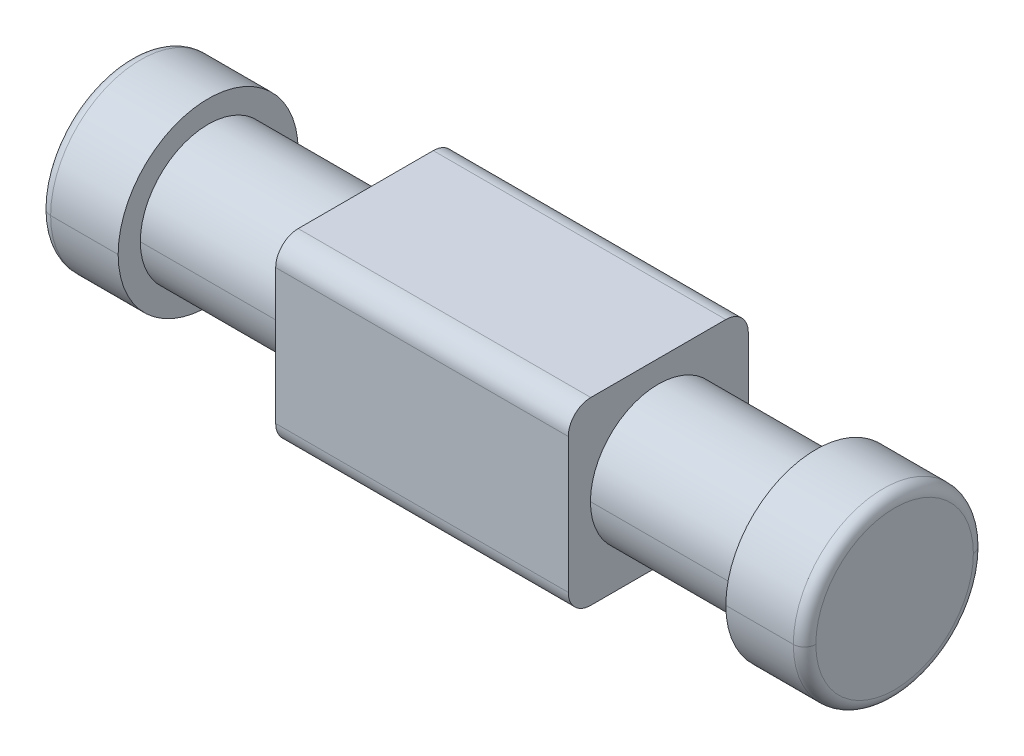
ISO-10303-21;
HEADER;
FILE_DESCRIPTION(('STEP AP214'),'2;1');
FILE_NAME('part.step','',(''),(''),'','','');
FILE_SCHEMA(('AUTOMOTIVE_DESIGN { 1 0 10303 214 1 1 1 1 }'));
ENDSEC;
DATA;
#1=APPLICATION_CONTEXT('core data for automotive mechanical design processes');
#2=APPLICATION_PROTOCOL_DEFINITION('international standard','automotive_design',2000,#1);
#3=PRODUCT_CONTEXT('',#1,'mechanical');
#4=PRODUCT('Part','Part','',(#3));
#5=PRODUCT_RELATED_PRODUCT_CATEGORY('part','',(#4));
#6=PRODUCT_DEFINITION_FORMATION('','',#4);
#7=PRODUCT_DEFINITION_CONTEXT('part definition',#1,'design');
#8=PRODUCT_DEFINITION('design','',#6,#7);
#9=PRODUCT_DEFINITION_SHAPE('','',#8);
#10=(LENGTH_UNIT() NAMED_UNIT(*) SI_UNIT(.MILLI.,.METRE.));
#11=(NAMED_UNIT(*) PLANE_ANGLE_UNIT() SI_UNIT($,.RADIAN.));
#12=(NAMED_UNIT(*) SI_UNIT($,.STERADIAN.) SOLID_ANGLE_UNIT());
#13=UNCERTAINTY_MEASURE_WITH_UNIT(LENGTH_MEASURE(1.E-05),#10,'distance_accuracy_value','');
#14=(GEOMETRIC_REPRESENTATION_CONTEXT(3) GLOBAL_UNCERTAINTY_ASSIGNED_CONTEXT((#13)) GLOBAL_UNIT_ASSIGNED_CONTEXT((#10,
#11,#12)) REPRESENTATION_CONTEXT('',''));
#15=CARTESIAN_POINT('',(0.,0.,0.));
#16=DIRECTION('',(0.,0.,1.));
#17=DIRECTION('',(1.,0.,0.));
#18=AXIS2_PLACEMENT_3D('',#15,#16,#17);
#19=CARTESIAN_POINT('',(3.3,0.,0.));
#20=DIRECTION('',(1.,0.,0.));
#21=DIRECTION('',(0.,0.,-1.));
#22=AXIS2_PLACEMENT_3D('',#19,#20,#21);
#23=TOROIDAL_SURFACE('',#22,0.7,0.1);
#24=CARTESIAN_POINT('',(3.3,0.,0.7));
#25=DIRECTION('',(0.,1.,0.));
#26=DIRECTION('',(0.,0.,1.));
#27=AXIS2_PLACEMENT_3D('',#24,#25,#26);
#28=CIRCLE('',#27,0.1);
#29=CARTESIAN_POINT('',(3.3,0.,0.8));
#30=VERTEX_POINT('',#29);
#31=CARTESIAN_POINT('',(3.4,0.,0.7));
#32=VERTEX_POINT('',#31);
#33=EDGE_CURVE('E206',#30,#32,#28,.T.);
#34=ORIENTED_EDGE('',*,*,#33,.F.);
#35=CARTESIAN_POINT('',(3.3,0.,0.));
#36=DIRECTION('',(-1.,0.,0.));
#37=DIRECTION('',(0.,0.,-1.));
#38=AXIS2_PLACEMENT_3D('',#35,#36,#37);
#39=CIRCLE('',#38,0.8);
#40=CARTESIAN_POINT('',(3.3,0.,-0.8));
#41=VERTEX_POINT('',#40);
#42=EDGE_CURVE('E20',#41,#30,#39,.T.);
#43=ORIENTED_EDGE('',*,*,#42,.F.);
#44=CARTESIAN_POINT('',(3.3,0.,-0.7));
#45=DIRECTION('',(0.,-1.,0.));
#46=DIRECTION('',(0.,0.,-1.));
#47=AXIS2_PLACEMENT_3D('',#44,#45,#46);
#48=CIRCLE('',#47,0.1);
#49=CARTESIAN_POINT('',(3.4,0.,-0.7));
#50=VERTEX_POINT('',#49);
#51=EDGE_CURVE('E215',#41,#50,#48,.T.);
#52=ORIENTED_EDGE('',*,*,#51,.T.);
#53=CARTESIAN_POINT('',(3.4,0.,0.));
#54=DIRECTION('',(1.,0.,0.));
#55=DIRECTION('',(0.,0.,-1.));
#56=AXIS2_PLACEMENT_3D('',#53,#54,#55);
#57=CIRCLE('',#56,0.7);
#58=EDGE_CURVE('E207',#32,#50,#57,.T.);
#59=ORIENTED_EDGE('',*,*,#58,.F.);
#60=EDGE_LOOP('',(#34,#43,#52,#59));
#61=FACE_BOUND('',#60,.T.);
#62=ADVANCED_FACE('F17',(#61),#23,.T.);
#63=CARTESIAN_POINT('',(-3.3,0.,0.));
#64=DIRECTION('',(1.,0.,0.));
#65=DIRECTION('',(0.,0.,-1.));
#66=AXIS2_PLACEMENT_3D('',#63,#64,#65);
#67=TOROIDAL_SURFACE('',#66,0.7,0.1);
#68=CARTESIAN_POINT('',(-3.3,0.,0.7));
#69=DIRECTION('',(0.,1.,0.));
#70=DIRECTION('',(0.,0.,1.));
#71=AXIS2_PLACEMENT_3D('',#68,#69,#70);
#72=CIRCLE('',#71,0.1);
#73=CARTESIAN_POINT('',(-3.4,0.,0.7));
#74=VERTEX_POINT('',#73);
#75=CARTESIAN_POINT('',(-3.3,0.,0.8));
#76=VERTEX_POINT('',#75);
#77=EDGE_CURVE('E261',#74,#76,#72,.T.);
#78=ORIENTED_EDGE('',*,*,#77,.F.);
#79=CARTESIAN_POINT('',(-3.4,0.,0.));
#80=DIRECTION('',(-1.,0.,0.));
#81=DIRECTION('',(0.,0.,-1.));
#82=AXIS2_PLACEMENT_3D('',#79,#80,#81);
#83=CIRCLE('',#82,0.7);
#84=CARTESIAN_POINT('',(-3.4,0.,-0.7));
#85=VERTEX_POINT('',#84);
#86=EDGE_CURVE('E245',#85,#74,#83,.T.);
#87=ORIENTED_EDGE('',*,*,#86,.F.);
#88=CARTESIAN_POINT('',(-3.3,0.,-0.7));
#89=DIRECTION('',(0.,-1.,0.));
#90=DIRECTION('',(0.,0.,-1.));
#91=AXIS2_PLACEMENT_3D('',#88,#89,#90);
#92=CIRCLE('',#91,0.1);
#93=CARTESIAN_POINT('',(-3.3,0.,-0.8));
#94=VERTEX_POINT('',#93);
#95=EDGE_CURVE('E269',#85,#94,#92,.T.);
#96=ORIENTED_EDGE('',*,*,#95,.T.);
#97=CARTESIAN_POINT('',(-3.3,0.,0.));
#98=DIRECTION('',(1.,0.,0.));
#99=DIRECTION('',(0.,0.,-1.));
#100=AXIS2_PLACEMENT_3D('',#97,#98,#99);
#101=CIRCLE('',#100,0.8);
#102=EDGE_CURVE('E274',#76,#94,#101,.T.);
#103=ORIENTED_EDGE('',*,*,#102,.F.);
#104=EDGE_LOOP('',(#78,#87,#96,#103));
#105=FACE_BOUND('',#104,.T.);
#106=ADVANCED_FACE('F418',(#105),#67,.T.);
#107=CARTESIAN_POINT('',(4.405304178592,0.,0.));
#108=DIRECTION('',(-1.,0.,0.));
#109=DIRECTION('',(0.,0.,1.));
#110=AXIS2_PLACEMENT_3D('',#107,#108,#109);
#111=CYLINDRICAL_SURFACE('',#110,0.602916074334);
#112=DIRECTION('',(-1.,0.,0.));
#113=VECTOR('',#112,1.);
#114=CARTESIAN_POINT('',(4.405304178592,0.,-0.602916074334));
#115=LINE('',#114,#113);
#116=CARTESIAN_POINT('',(2.7,0.,-0.602916074334));
#117=VERTEX_POINT('',#116);
#118=CARTESIAN_POINT('',(1.3,0.,-0.602916074334));
#119=VERTEX_POINT('',#118);
#120=EDGE_CURVE('E280',#117,#119,#115,.T.);
#121=ORIENTED_EDGE('',*,*,#120,.F.);
#122=CARTESIAN_POINT('',(2.7,0.,0.));
#123=DIRECTION('',(1.,0.,0.));
#124=DIRECTION('',(0.,0.,-1.));
#125=AXIS2_PLACEMENT_3D('',#122,#123,#124);
#126=CIRCLE('',#125,0.602916074334);
#127=CARTESIAN_POINT('',(2.7,0.,0.602916074334));
#128=VERTEX_POINT('',#127);
#129=EDGE_CURVE('E11',#128,#117,#126,.T.);
#130=ORIENTED_EDGE('',*,*,#129,.F.);
#131=DIRECTION('',(-1.,0.,0.));
#132=VECTOR('',#131,1.);
#133=CARTESIAN_POINT('',(4.405304178592,0.,0.602916074334));
#134=LINE('',#133,#132);
#135=CARTESIAN_POINT('',(1.3,0.,0.602916074334));
#136=VERTEX_POINT('',#135);
#137=EDGE_CURVE('E283',#128,#136,#134,.T.);
#138=ORIENTED_EDGE('',*,*,#137,.T.);
#139=CARTESIAN_POINT('',(1.3,0.,0.));
#140=DIRECTION('',(1.,0.,0.));
#141=DIRECTION('',(0.,0.,-1.));
#142=AXIS2_PLACEMENT_3D('',#139,#140,#141);
#143=CIRCLE('',#142,0.602916074334);
#144=EDGE_CURVE('E358',#136,#119,#143,.T.);
#145=ORIENTED_EDGE('',*,*,#144,.T.);
#146=EDGE_LOOP('',(#121,#130,#138,#145));
#147=FACE_BOUND('',#146,.T.);
#148=ADVANCED_FACE('F392',(#147),#111,.T.);
#149=CARTESIAN_POINT('',(2.7,0.,0.));
#150=DIRECTION('',(1.,0.,0.));
#151=DIRECTION('',(0.,1.,0.));
#152=AXIS2_PLACEMENT_3D('',#149,#150,#151);
#153=PLANE('',#152);
#154=CARTESIAN_POINT('',(2.7,0.,0.));
#155=DIRECTION('',(1.,0.,0.));
#156=DIRECTION('',(0.,0.,-1.));
#157=AXIS2_PLACEMENT_3D('',#154,#155,#156);
#158=CIRCLE('',#157,0.8);
#159=CARTESIAN_POINT('',(2.7,0.,-0.8));
#160=VERTEX_POINT('',#159);
#161=CARTESIAN_POINT('',(2.7,0.,0.8));
#162=VERTEX_POINT('',#161);
#163=EDGE_CURVE('E202',#160,#162,#158,.T.);
#164=ORIENTED_EDGE('',*,*,#163,.F.);
#165=CARTESIAN_POINT('',(2.7,0.,0.));
#166=DIRECTION('',(1.,0.,0.));
#167=DIRECTION('',(0.,0.,-1.));
#168=AXIS2_PLACEMENT_3D('',#165,#166,#167);
#169=CIRCLE('',#168,0.8);
#170=EDGE_CURVE('E195',#162,#160,#169,.T.);
#171=ORIENTED_EDGE('',*,*,#170,.F.);
#172=EDGE_LOOP('',(#164,#171));
#173=FACE_BOUND('',#172,.T.);
#174=ORIENTED_EDGE('',*,*,#129,.T.);
#175=CARTESIAN_POINT('',(2.7,0.,0.));
#176=DIRECTION('',(1.,0.,0.));
#177=DIRECTION('',(0.,0.,-1.));
#178=AXIS2_PLACEMENT_3D('',#175,#176,#177);
#179=CIRCLE('',#178,0.602916074334);
#180=EDGE_CURVE('E273',#117,#128,#179,.T.);
#181=ORIENTED_EDGE('',*,*,#180,.T.);
#182=EDGE_LOOP('',(#174,#181));
#183=FACE_BOUND('',#182,.T.);
#184=ADVANCED_FACE('F389',(#173,#183),#153,.F.);
#185=CARTESIAN_POINT('',(2.7,0.,0.));
#186=DIRECTION('',(1.,0.,0.));
#187=DIRECTION('',(0.,0.,-1.));
#188=AXIS2_PLACEMENT_3D('',#185,#186,#187);
#189=CYLINDRICAL_SURFACE('',#188,0.8);
#190=DIRECTION('',(1.,0.,0.));
#191=VECTOR('',#190,1.);
#192=CARTESIAN_POINT('',(2.7,0.,0.8));
#193=LINE('',#192,#191);
#194=EDGE_CURVE('E186',#162,#30,#193,.T.);
#195=ORIENTED_EDGE('',*,*,#194,.F.);
#196=ORIENTED_EDGE('',*,*,#170,.T.);
#197=DIRECTION('',(1.,0.,0.));
#198=VECTOR('',#197,1.);
#199=CARTESIAN_POINT('',(2.7,0.,-0.8));
#200=LINE('',#199,#198);
#201=EDGE_CURVE('E189',#160,#41,#200,.T.);
#202=ORIENTED_EDGE('',*,*,#201,.T.);
#203=ORIENTED_EDGE('',*,*,#42,.T.);
#204=EDGE_LOOP('',(#195,#196,#202,#203));
#205=FACE_BOUND('',#204,.T.);
#206=ADVANCED_FACE('F185',(#205),#189,.T.);
#207=CARTESIAN_POINT('',(3.4,0.,0.));
#208=DIRECTION('',(1.,0.,0.));
#209=DIRECTION('',(0.,1.,0.));
#210=AXIS2_PLACEMENT_3D('',#207,#208,#209);
#211=PLANE('',#210);
#212=CARTESIAN_POINT('',(3.4,0.,0.));
#213=DIRECTION('',(1.,0.,0.));
#214=DIRECTION('',(0.,0.,-1.));
#215=AXIS2_PLACEMENT_3D('',#212,#213,#214);
#216=CIRCLE('',#215,0.7);
#217=EDGE_CURVE('E212',#50,#32,#216,.T.);
#218=ORIENTED_EDGE('',*,*,#217,.T.);
#219=ORIENTED_EDGE('',*,*,#58,.T.);
#220=EDGE_LOOP('',(#218,#219));
#221=FACE_BOUND('',#220,.T.);
#222=ADVANCED_FACE('F405',(#221),#211,.T.);
#223=CARTESIAN_POINT('',(1.3,-0.6,-0.6));
#224=DIRECTION('',(1.,0.,0.));
#225=DIRECTION('',(0.,1.,0.));
#226=AXIS2_PLACEMENT_3D('',#223,#224,#225);
#227=PLANE('',#226);
#228=CARTESIAN_POINT('',(1.3,-0.6,-0.6));
#229=DIRECTION('',(1.,0.,0.));
#230=DIRECTION('',(0.,0.,-1.));
#231=AXIS2_PLACEMENT_3D('',#228,#229,#230);
#232=CIRCLE('',#231,0.2);
#233=CARTESIAN_POINT('',(1.3,-0.8,-0.6));
#234=VERTEX_POINT('',#233);
#235=CARTESIAN_POINT('',(1.3,-0.6,-0.8));
#236=VERTEX_POINT('',#235);
#237=EDGE_CURVE('E244',#234,#236,#232,.T.);
#238=ORIENTED_EDGE('',*,*,#237,.T.);
#239=DIRECTION('',(0.,1.,0.));
#240=VECTOR('',#239,1.);
#241=CARTESIAN_POINT('',(1.3,-0.6,-0.8));
#242=LINE('',#241,#240);
#243=CARTESIAN_POINT('',(1.3,0.6,-0.8));
#244=VERTEX_POINT('',#243);
#245=EDGE_CURVE('E48',#236,#244,#242,.T.);
#246=ORIENTED_EDGE('',*,*,#245,.T.);
#247=CARTESIAN_POINT('',(1.3,0.6,-0.6));
#248=DIRECTION('',(1.,0.,0.));
#249=DIRECTION('',(0.,0.,-1.));
#250=AXIS2_PLACEMENT_3D('',#247,#248,#249);
#251=CIRCLE('',#250,0.2);
#252=CARTESIAN_POINT('',(1.3,0.8,-0.6));
#253=VERTEX_POINT('',#252);
#254=EDGE_CURVE('E362',#244,#253,#251,.T.);
#255=ORIENTED_EDGE('',*,*,#254,.T.);
#256=DIRECTION('',(0.,0.,1.));
#257=VECTOR('',#256,1.);
#258=CARTESIAN_POINT('',(1.3,0.8,-0.6));
#259=LINE('',#258,#257);
#260=CARTESIAN_POINT('',(1.3,0.8,0.6));
#261=VERTEX_POINT('',#260);
#262=EDGE_CURVE('E230',#253,#261,#259,.T.);
#263=ORIENTED_EDGE('',*,*,#262,.T.);
#264=CARTESIAN_POINT('',(1.3,0.6,0.6));
#265=DIRECTION('',(1.,0.,0.));
#266=DIRECTION('',(0.,0.,-1.));
#267=AXIS2_PLACEMENT_3D('',#264,#265,#266);
#268=CIRCLE('',#267,0.2);
#269=CARTESIAN_POINT('',(1.3,0.6,0.8));
#270=VERTEX_POINT('',#269);
#271=EDGE_CURVE('E238',#261,#270,#268,.T.);
#272=ORIENTED_EDGE('',*,*,#271,.T.);
#273=DIRECTION('',(0.,-1.,0.));
#274=VECTOR('',#273,1.);
#275=CARTESIAN_POINT('',(1.3,-0.6,0.8));
#276=LINE('',#275,#274);
#277=CARTESIAN_POINT('',(1.3,-0.6,0.8));
#278=VERTEX_POINT('',#277);
#279=EDGE_CURVE('E361',#270,#278,#276,.T.);
#280=ORIENTED_EDGE('',*,*,#279,.T.);
#281=CARTESIAN_POINT('',(1.3,-0.6,0.6));
#282=DIRECTION('',(1.,0.,0.));
#283=DIRECTION('',(0.,0.,1.));
#284=AXIS2_PLACEMENT_3D('',#281,#282,#283);
#285=CIRCLE('',#284,0.2);
#286=CARTESIAN_POINT('',(1.3,-0.8,0.6));
#287=VERTEX_POINT('',#286);
#288=EDGE_CURVE('E316',#278,#287,#285,.T.);
#289=ORIENTED_EDGE('',*,*,#288,.T.);
#290=DIRECTION('',(0.,0.,-1.));
#291=VECTOR('',#290,1.);
#292=CARTESIAN_POINT('',(1.3,-0.8,-0.6));
#293=LINE('',#292,#291);
#294=EDGE_CURVE('E223',#287,#234,#293,.T.);
#295=ORIENTED_EDGE('',*,*,#294,.T.);
#296=EDGE_LOOP('',(#238,#246,#255,#263,#272,#280,#289,#295));
#297=FACE_BOUND('',#296,.T.);
#298=ORIENTED_EDGE('',*,*,#144,.F.);
#299=CARTESIAN_POINT('',(1.3,0.,0.));
#300=DIRECTION('',(1.,0.,0.));
#301=DIRECTION('',(0.,0.,-1.));
#302=AXIS2_PLACEMENT_3D('',#299,#300,#301);
#303=CIRCLE('',#302,0.602916074334);
#304=EDGE_CURVE('E287',#119,#136,#303,.T.);
#305=ORIENTED_EDGE('',*,*,#304,.F.);
#306=EDGE_LOOP('',(#298,#305));
#307=FACE_BOUND('',#306,.T.);
#308=ADVANCED_FACE('F402',(#297,#307),#227,.T.);
#309=CARTESIAN_POINT('',(-1.3,-0.6,-0.6));
#310=DIRECTION('',(1.,0.,0.));
#311=DIRECTION('',(0.,1.,0.));
#312=AXIS2_PLACEMENT_3D('',#309,#310,#311);
#313=PLANE('',#312);
#314=CARTESIAN_POINT('',(-1.3,-0.6,-0.6));
#315=DIRECTION('',(1.,0.,0.));
#316=DIRECTION('',(0.,0.,-1.));
#317=AXIS2_PLACEMENT_3D('',#314,#315,#316);
#318=CIRCLE('',#317,0.2);
#319=CARTESIAN_POINT('',(-1.3,-0.8,-0.6));
#320=VERTEX_POINT('',#319);
#321=CARTESIAN_POINT('',(-1.3,-0.6,-0.8));
#322=VERTEX_POINT('',#321);
#323=EDGE_CURVE('E342',#320,#322,#318,.T.);
#324=ORIENTED_EDGE('',*,*,#323,.F.);
#325=DIRECTION('',(0.,0.,-1.));
#326=VECTOR('',#325,1.);
#327=CARTESIAN_POINT('',(-1.3,-0.8,-0.6));
#328=LINE('',#327,#326);
#329=CARTESIAN_POINT('',(-1.3,-0.8,0.6));
#330=VERTEX_POINT('',#329);
#331=EDGE_CURVE('E313',#330,#320,#328,.T.);
#332=ORIENTED_EDGE('',*,*,#331,.F.);
#333=CARTESIAN_POINT('',(-1.3,-0.6,0.6));
#334=DIRECTION('',(1.,0.,0.));
#335=DIRECTION('',(0.,0.,1.));
#336=AXIS2_PLACEMENT_3D('',#333,#334,#335);
#337=CIRCLE('',#336,0.2);
#338=CARTESIAN_POINT('',(-1.3,-0.6,0.8));
#339=VERTEX_POINT('',#338);
#340=EDGE_CURVE('E355',#339,#330,#337,.T.);
#341=ORIENTED_EDGE('',*,*,#340,.F.);
#342=DIRECTION('',(0.,-1.,0.));
#343=VECTOR('',#342,1.);
#344=CARTESIAN_POINT('',(-1.3,-0.6,0.8));
#345=LINE('',#344,#343);
#346=CARTESIAN_POINT('',(-1.3,0.6,0.8));
#347=VERTEX_POINT('',#346);
#348=EDGE_CURVE('E235',#347,#339,#345,.T.);
#349=ORIENTED_EDGE('',*,*,#348,.F.);
#350=CARTESIAN_POINT('',(-1.3,0.6,0.6));
#351=DIRECTION('',(1.,0.,0.));
#352=DIRECTION('',(0.,0.,-1.));
#353=AXIS2_PLACEMENT_3D('',#350,#351,#352);
#354=CIRCLE('',#353,0.2);
#355=CARTESIAN_POINT('',(-1.3,0.8,0.6));
#356=VERTEX_POINT('',#355);
#357=EDGE_CURVE('E234',#356,#347,#354,.T.);
#358=ORIENTED_EDGE('',*,*,#357,.F.);
#359=DIRECTION('',(0.,0.,1.));
#360=VECTOR('',#359,1.);
#361=CARTESIAN_POINT('',(-1.3,0.8,-0.6));
#362=LINE('',#361,#360);
#363=CARTESIAN_POINT('',(-1.3,0.8,-0.6));
#364=VERTEX_POINT('',#363);
#365=EDGE_CURVE('E329',#364,#356,#362,.T.);
#366=ORIENTED_EDGE('',*,*,#365,.F.);
#367=CARTESIAN_POINT('',(-1.3,0.6,-0.6));
#368=DIRECTION('',(1.,0.,0.));
#369=DIRECTION('',(0.,0.,-1.));
#370=AXIS2_PLACEMENT_3D('',#367,#368,#369);
#371=CIRCLE('',#370,0.2);
#372=CARTESIAN_POINT('',(-1.3,0.6,-0.8));
#373=VERTEX_POINT('',#372);
#374=EDGE_CURVE('E249',#373,#364,#371,.T.);
#375=ORIENTED_EDGE('',*,*,#374,.F.);
#376=DIRECTION('',(0.,1.,0.));
#377=VECTOR('',#376,1.);
#378=CARTESIAN_POINT('',(-1.3,-0.6,-0.8));
#379=LINE('',#378,#377);
#380=EDGE_CURVE('E38',#322,#373,#379,.T.);
#381=ORIENTED_EDGE('',*,*,#380,.F.);
#382=EDGE_LOOP('',(#324,#332,#341,#349,#358,#366,#375,#381));
#383=FACE_BOUND('',#382,.T.);
#384=CARTESIAN_POINT('',(-1.3,0.,0.));
#385=DIRECTION('',(1.,0.,0.));
#386=DIRECTION('',(0.,0.,-1.));
#387=AXIS2_PLACEMENT_3D('',#384,#385,#386);
#388=CIRCLE('',#387,0.602916074334);
#389=CARTESIAN_POINT('',(-1.3,0.,0.602916074334));
#390=VERTEX_POINT('',#389);
#391=CARTESIAN_POINT('',(-1.3,0.,-0.602916074334));
#392=VERTEX_POINT('',#391);
#393=EDGE_CURVE('E257',#390,#392,#388,.T.);
#394=ORIENTED_EDGE('',*,*,#393,.T.);
#395=CARTESIAN_POINT('',(-1.3,0.,0.));
#396=DIRECTION('',(1.,0.,0.));
#397=DIRECTION('',(0.,0.,-1.));
#398=AXIS2_PLACEMENT_3D('',#395,#396,#397);
#399=CIRCLE('',#398,0.602916074334);
#400=EDGE_CURVE('E297',#392,#390,#399,.T.);
#401=ORIENTED_EDGE('',*,*,#400,.T.);
#402=EDGE_LOOP('',(#394,#401));
#403=FACE_BOUND('',#402,.T.);
#404=ADVANCED_FACE('F404',(#383,#403),#313,.F.);
#405=CARTESIAN_POINT('',(-1.3,-0.6,-0.8));
#406=DIRECTION('',(0.,0.,-1.));
#407=DIRECTION('',(0.,-1.,0.));
#408=AXIS2_PLACEMENT_3D('',#405,#406,#407);
#409=PLANE('',#408);
#410=DIRECTION('',(1.,0.,0.));
#411=VECTOR('',#410,1.);
#412=CARTESIAN_POINT('',(-1.3,0.6,-0.8));
#413=LINE('',#412,#411);
#414=EDGE_CURVE('E252',#373,#244,#413,.T.);
#415=ORIENTED_EDGE('',*,*,#414,.T.);
#416=ORIENTED_EDGE('',*,*,#245,.F.);
#417=DIRECTION('',(1.,0.,0.));
#418=VECTOR('',#417,1.);
#419=CARTESIAN_POINT('',(-1.3,-0.6,-0.8));
#420=LINE('',#419,#418);
#421=EDGE_CURVE('E240',#322,#236,#420,.T.);
#422=ORIENTED_EDGE('',*,*,#421,.F.);
#423=ORIENTED_EDGE('',*,*,#380,.T.);
#424=EDGE_LOOP('',(#415,#416,#422,#423));
#425=FACE_BOUND('',#424,.T.);
#426=ADVANCED_FACE('F412',(#425),#409,.T.);
#427=CARTESIAN_POINT('',(-1.3,0.6,-0.6));
#428=DIRECTION('',(1.,0.,0.));
#429=DIRECTION('',(0.,0.,-1.));
#430=AXIS2_PLACEMENT_3D('',#427,#428,#429);
#431=CYLINDRICAL_SURFACE('',#430,0.2);
#432=DIRECTION('',(1.,0.,0.));
#433=VECTOR('',#432,1.);
#434=CARTESIAN_POINT('',(-1.3,0.8,-0.6));
#435=LINE('',#434,#433);
#436=EDGE_CURVE('E233',#364,#253,#435,.T.);
#437=ORIENTED_EDGE('',*,*,#436,.T.);
#438=ORIENTED_EDGE('',*,*,#254,.F.);
#439=ORIENTED_EDGE('',*,*,#414,.F.);
#440=ORIENTED_EDGE('',*,*,#374,.T.);
#441=EDGE_LOOP('',(#437,#438,#439,#440));
#442=FACE_BOUND('',#441,.T.);
#443=ADVANCED_FACE('F467',(#442),#431,.T.);
#444=CARTESIAN_POINT('',(-1.3,0.8,-0.6));
#445=DIRECTION('',(0.,1.,0.));
#446=DIRECTION('',(0.,0.,-1.));
#447=AXIS2_PLACEMENT_3D('',#444,#445,#446);
#448=PLANE('',#447);
#449=DIRECTION('',(1.,0.,0.));
#450=VECTOR('',#449,1.);
#451=CARTESIAN_POINT('',(-1.3,0.8,0.6));
#452=LINE('',#451,#450);
#453=EDGE_CURVE('E372',#356,#261,#452,.T.);
#454=ORIENTED_EDGE('',*,*,#453,.T.);
#455=ORIENTED_EDGE('',*,*,#262,.F.);
#456=ORIENTED_EDGE('',*,*,#436,.F.);
#457=ORIENTED_EDGE('',*,*,#365,.T.);
#458=EDGE_LOOP('',(#454,#455,#456,#457));
#459=FACE_BOUND('',#458,.T.);
#460=ADVANCED_FACE('F477',(#459),#448,.T.);
#461=CARTESIAN_POINT('',(-1.3,0.6,0.6));
#462=DIRECTION('',(1.,0.,0.));
#463=DIRECTION('',(0.,0.,-1.));
#464=AXIS2_PLACEMENT_3D('',#461,#462,#463);
#465=CYLINDRICAL_SURFACE('',#464,0.2);
#466=DIRECTION('',(1.,0.,0.));
#467=VECTOR('',#466,1.);
#468=CARTESIAN_POINT('',(-1.3,0.6,0.8));
#469=LINE('',#468,#467);
#470=EDGE_CURVE('E239',#347,#270,#469,.T.);
#471=ORIENTED_EDGE('',*,*,#470,.T.);
#472=ORIENTED_EDGE('',*,*,#271,.F.);
#473=ORIENTED_EDGE('',*,*,#453,.F.);
#474=ORIENTED_EDGE('',*,*,#357,.T.);
#475=EDGE_LOOP('',(#471,#472,#473,#474));
#476=FACE_BOUND('',#475,.T.);
#477=ADVANCED_FACE('F488',(#476),#465,.T.);
#478=CARTESIAN_POINT('',(-1.3,-0.6,0.8));
#479=DIRECTION('',(0.,0.,1.));
#480=DIRECTION('',(1.,0.,0.));
#481=AXIS2_PLACEMENT_3D('',#478,#479,#480);
#482=PLANE('',#481);
#483=DIRECTION('',(1.,0.,0.));
#484=VECTOR('',#483,1.);
#485=CARTESIAN_POINT('',(-1.3,-0.6,0.8));
#486=LINE('',#485,#484);
#487=EDGE_CURVE('E351',#339,#278,#486,.T.);
#488=ORIENTED_EDGE('',*,*,#487,.T.);
#489=ORIENTED_EDGE('',*,*,#279,.F.);
#490=ORIENTED_EDGE('',*,*,#470,.F.);
#491=ORIENTED_EDGE('',*,*,#348,.T.);
#492=EDGE_LOOP('',(#488,#489,#490,#491));
#493=FACE_BOUND('',#492,.T.);
#494=ADVANCED_FACE('F499',(#493),#482,.T.);
#495=CARTESIAN_POINT('',(-1.3,-0.6,0.6));
#496=DIRECTION('',(1.,0.,0.));
#497=DIRECTION('',(0.,0.,-1.));
#498=AXIS2_PLACEMENT_3D('',#495,#496,#497);
#499=CYLINDRICAL_SURFACE('',#498,0.2);
#500=DIRECTION('',(1.,0.,0.));
#501=VECTOR('',#500,1.);
#502=CARTESIAN_POINT('',(-1.3,-0.8,0.6));
#503=LINE('',#502,#501);
#504=EDGE_CURVE('E317',#330,#287,#503,.T.);
#505=ORIENTED_EDGE('',*,*,#504,.T.);
#506=ORIENTED_EDGE('',*,*,#288,.F.);
#507=ORIENTED_EDGE('',*,*,#487,.F.);
#508=ORIENTED_EDGE('',*,*,#340,.T.);
#509=EDGE_LOOP('',(#505,#506,#507,#508));
#510=FACE_BOUND('',#509,.T.);
#511=ADVANCED_FACE('F510',(#510),#499,.T.);
#512=CARTESIAN_POINT('',(-1.3,-0.8,-0.6));
#513=DIRECTION('',(0.,-1.,0.));
#514=DIRECTION('',(0.,0.,-1.));
#515=AXIS2_PLACEMENT_3D('',#512,#513,#514);
#516=PLANE('',#515);
#517=DIRECTION('',(1.,0.,0.));
#518=VECTOR('',#517,1.);
#519=CARTESIAN_POINT('',(-1.3,-0.8,-0.6));
#520=LINE('',#519,#518);
#521=EDGE_CURVE('E295',#320,#234,#520,.T.);
#522=ORIENTED_EDGE('',*,*,#521,.T.);
#523=ORIENTED_EDGE('',*,*,#294,.F.);
#524=ORIENTED_EDGE('',*,*,#504,.F.);
#525=ORIENTED_EDGE('',*,*,#331,.T.);
#526=EDGE_LOOP('',(#522,#523,#524,#525));
#527=FACE_BOUND('',#526,.T.);
#528=ADVANCED_FACE('F521',(#527),#516,.T.);
#529=CARTESIAN_POINT('',(-1.3,-0.6,-0.6));
#530=DIRECTION('',(1.,0.,0.));
#531=DIRECTION('',(0.,0.,-1.));
#532=AXIS2_PLACEMENT_3D('',#529,#530,#531);
#533=CYLINDRICAL_SURFACE('',#532,0.2);
#534=ORIENTED_EDGE('',*,*,#421,.T.);
#535=ORIENTED_EDGE('',*,*,#237,.F.);
#536=ORIENTED_EDGE('',*,*,#521,.F.);
#537=ORIENTED_EDGE('',*,*,#323,.T.);
#538=EDGE_LOOP('',(#534,#535,#536,#537));
#539=FACE_BOUND('',#538,.T.);
#540=ADVANCED_FACE('F532',(#539),#533,.T.);
#541=CARTESIAN_POINT('',(-3.4,0.,0.));
#542=DIRECTION('',(1.,0.,0.));
#543=DIRECTION('',(0.,1.,0.));
#544=AXIS2_PLACEMENT_3D('',#541,#542,#543);
#545=PLANE('',#544);
#546=ORIENTED_EDGE('',*,*,#86,.T.);
#547=CARTESIAN_POINT('',(-3.4,0.,0.));
#548=DIRECTION('',(-1.,0.,0.));
#549=DIRECTION('',(0.,0.,-1.));
#550=AXIS2_PLACEMENT_3D('',#547,#548,#549);
#551=CIRCLE('',#550,0.7);
#552=EDGE_CURVE('E248',#74,#85,#551,.T.);
#553=ORIENTED_EDGE('',*,*,#552,.T.);
#554=EDGE_LOOP('',(#546,#553));
#555=FACE_BOUND('',#554,.T.);
#556=ADVANCED_FACE('F543',(#555),#545,.F.);
#557=CARTESIAN_POINT('',(-2.7,0.,0.));
#558=DIRECTION('',(1.,0.,0.));
#559=DIRECTION('',(0.,1.,0.));
#560=AXIS2_PLACEMENT_3D('',#557,#558,#559);
#561=PLANE('',#560);
#562=CARTESIAN_POINT('',(-2.7,0.,0.));
#563=DIRECTION('',(1.,0.,0.));
#564=DIRECTION('',(0.,0.,-1.));
#565=AXIS2_PLACEMENT_3D('',#562,#563,#564);
#566=CIRCLE('',#565,0.8);
#567=CARTESIAN_POINT('',(-2.7,0.,0.8));
#568=VERTEX_POINT('',#567);
#569=CARTESIAN_POINT('',(-2.7,0.,-0.8));
#570=VERTEX_POINT('',#569);
#571=EDGE_CURVE('E256',#568,#570,#566,.T.);
#572=ORIENTED_EDGE('',*,*,#571,.T.);
#573=CARTESIAN_POINT('',(-2.7,0.,0.));
#574=DIRECTION('',(1.,0.,0.));
#575=DIRECTION('',(0.,0.,-1.));
#576=AXIS2_PLACEMENT_3D('',#573,#574,#575);
#577=CIRCLE('',#576,0.8);
#578=EDGE_CURVE('E226',#570,#568,#577,.T.);
#579=ORIENTED_EDGE('',*,*,#578,.T.);
#580=EDGE_LOOP('',(#572,#579));
#581=FACE_BOUND('',#580,.T.);
#582=CARTESIAN_POINT('',(-2.7,0.,0.));
#583=DIRECTION('',(1.,0.,0.));
#584=DIRECTION('',(0.,0.,-1.));
#585=AXIS2_PLACEMENT_3D('',#582,#583,#584);
#586=CIRCLE('',#585,0.602916074334);
#587=CARTESIAN_POINT('',(-2.7,0.,0.602916074334));
#588=VERTEX_POINT('',#587);
#589=CARTESIAN_POINT('',(-2.7,0.,-0.602916074334));
#590=VERTEX_POINT('',#589);
#591=EDGE_CURVE('E253',#588,#590,#586,.T.);
#592=ORIENTED_EDGE('',*,*,#591,.F.);
#593=CARTESIAN_POINT('',(-2.7,0.,0.));
#594=DIRECTION('',(1.,0.,0.));
#595=DIRECTION('',(0.,0.,-1.));
#596=AXIS2_PLACEMENT_3D('',#593,#594,#595);
#597=CIRCLE('',#596,0.602916074334);
#598=EDGE_CURVE('E321',#590,#588,#597,.T.);
#599=ORIENTED_EDGE('',*,*,#598,.F.);
#600=EDGE_LOOP('',(#592,#599));
#601=FACE_BOUND('',#600,.T.);
#602=ADVANCED_FACE('F554',(#581,#601),#561,.T.);
#603=CARTESIAN_POINT('',(-2.7,0.,0.));
#604=DIRECTION('',(-1.,0.,0.));
#605=DIRECTION('',(0.,0.,1.));
#606=AXIS2_PLACEMENT_3D('',#603,#604,#605);
#607=CYLINDRICAL_SURFACE('',#606,0.8);
#608=DIRECTION('',(-1.,0.,0.));
#609=VECTOR('',#608,1.);
#610=CARTESIAN_POINT('',(-2.7,0.,-0.8));
#611=LINE('',#610,#609);
#612=EDGE_CURVE('E306',#570,#94,#611,.T.);
#613=ORIENTED_EDGE('',*,*,#612,.F.);
#614=ORIENTED_EDGE('',*,*,#571,.F.);
#615=DIRECTION('',(-1.,0.,0.));
#616=VECTOR('',#615,1.);
#617=CARTESIAN_POINT('',(-2.7,0.,0.8));
#618=LINE('',#617,#616);
#619=EDGE_CURVE('E302',#568,#76,#618,.T.);
#620=ORIENTED_EDGE('',*,*,#619,.T.);
#621=ORIENTED_EDGE('',*,*,#102,.T.);
#622=EDGE_LOOP('',(#613,#614,#620,#621));
#623=FACE_BOUND('',#622,.T.);
#624=ADVANCED_FACE('F565',(#623),#607,.T.);
#625=CARTESIAN_POINT('',(4.405304178592,0.,0.));
#626=DIRECTION('',(-1.,0.,0.));
#627=DIRECTION('',(0.,0.,1.));
#628=AXIS2_PLACEMENT_3D('',#625,#626,#627);
#629=CYLINDRICAL_SURFACE('',#628,0.602916074334);
#630=DIRECTION('',(-1.,0.,0.));
#631=VECTOR('',#630,1.);
#632=CARTESIAN_POINT('',(4.405304178592,0.,-0.602916074334));
#633=LINE('',#632,#631);
#634=EDGE_CURVE('E301',#392,#590,#633,.T.);
#635=ORIENTED_EDGE('',*,*,#634,.F.);
#636=ORIENTED_EDGE('',*,*,#393,.F.);
#637=DIRECTION('',(-1.,0.,0.));
#638=VECTOR('',#637,1.);
#639=CARTESIAN_POINT('',(4.405304178592,0.,0.602916074334));
#640=LINE('',#639,#638);
#641=EDGE_CURVE('E325',#390,#588,#640,.T.);
#642=ORIENTED_EDGE('',*,*,#641,.T.);
#643=ORIENTED_EDGE('',*,*,#591,.T.);
#644=EDGE_LOOP('',(#635,#636,#642,#643));
#645=FACE_BOUND('',#644,.T.);
#646=ADVANCED_FACE('F576',(#645),#629,.T.);
#647=CARTESIAN_POINT('',(4.405304178592,0.,0.));
#648=DIRECTION('',(-1.,0.,0.));
#649=DIRECTION('',(0.,0.,1.));
#650=AXIS2_PLACEMENT_3D('',#647,#648,#649);
#651=CYLINDRICAL_SURFACE('',#650,0.602916074334);
#652=ORIENTED_EDGE('',*,*,#400,.F.);
#653=ORIENTED_EDGE('',*,*,#634,.T.);
#654=ORIENTED_EDGE('',*,*,#598,.T.);
#655=ORIENTED_EDGE('',*,*,#641,.F.);
#656=EDGE_LOOP('',(#652,#653,#654,#655));
#657=FACE_BOUND('',#656,.T.);
#658=ADVANCED_FACE('F587',(#657),#651,.T.);
#659=CARTESIAN_POINT('',(-2.7,0.,0.));
#660=DIRECTION('',(-1.,0.,0.));
#661=DIRECTION('',(0.,0.,1.));
#662=AXIS2_PLACEMENT_3D('',#659,#660,#661);
#663=CYLINDRICAL_SURFACE('',#662,0.8);
#664=ORIENTED_EDGE('',*,*,#578,.F.);
#665=ORIENTED_EDGE('',*,*,#612,.T.);
#666=CARTESIAN_POINT('',(-3.3,0.,0.));
#667=DIRECTION('',(1.,0.,0.));
#668=DIRECTION('',(0.,0.,-1.));
#669=AXIS2_PLACEMENT_3D('',#666,#667,#668);
#670=CIRCLE('',#669,0.8);
#671=EDGE_CURVE('E265',#94,#76,#670,.T.);
#672=ORIENTED_EDGE('',*,*,#671,.T.);
#673=ORIENTED_EDGE('',*,*,#619,.F.);
#674=EDGE_LOOP('',(#664,#665,#672,#673));
#675=FACE_BOUND('',#674,.T.);
#676=ADVANCED_FACE('F598',(#675),#663,.T.);
#677=CARTESIAN_POINT('',(2.7,0.,0.));
#678=DIRECTION('',(1.,0.,0.));
#679=DIRECTION('',(0.,0.,-1.));
#680=AXIS2_PLACEMENT_3D('',#677,#678,#679);
#681=CYLINDRICAL_SURFACE('',#680,0.8);
#682=ORIENTED_EDGE('',*,*,#163,.T.);
#683=ORIENTED_EDGE('',*,*,#194,.T.);
#684=CARTESIAN_POINT('',(3.3,0.,0.));
#685=DIRECTION('',(-1.,0.,0.));
#686=DIRECTION('',(0.,0.,-1.));
#687=AXIS2_PLACEMENT_3D('',#684,#685,#686);
#688=CIRCLE('',#687,0.8);
#689=EDGE_CURVE('E200',#30,#41,#688,.T.);
#690=ORIENTED_EDGE('',*,*,#689,.T.);
#691=ORIENTED_EDGE('',*,*,#201,.F.);
#692=EDGE_LOOP('',(#682,#683,#690,#691));
#693=FACE_BOUND('',#692,.T.);
#694=ADVANCED_FACE('F198',(#693),#681,.T.);
#695=CARTESIAN_POINT('',(4.405304178592,0.,0.));
#696=DIRECTION('',(-1.,0.,0.));
#697=DIRECTION('',(0.,0.,1.));
#698=AXIS2_PLACEMENT_3D('',#695,#696,#697);
#699=CYLINDRICAL_SURFACE('',#698,0.602916074334);
#700=ORIENTED_EDGE('',*,*,#180,.F.);
#701=ORIENTED_EDGE('',*,*,#120,.T.);
#702=ORIENTED_EDGE('',*,*,#304,.T.);
#703=ORIENTED_EDGE('',*,*,#137,.F.);
#704=EDGE_LOOP('',(#700,#701,#702,#703));
#705=FACE_BOUND('',#704,.T.);
#706=ADVANCED_FACE('F400',(#705),#699,.T.);
#707=CARTESIAN_POINT('',(-3.3,0.,0.));
#708=DIRECTION('',(1.,0.,0.));
#709=DIRECTION('',(0.,0.,-1.));
#710=AXIS2_PLACEMENT_3D('',#707,#708,#709);
#711=TOROIDAL_SURFACE('',#710,0.7,0.1);
#712=ORIENTED_EDGE('',*,*,#552,.F.);
#713=ORIENTED_EDGE('',*,*,#77,.T.);
#714=ORIENTED_EDGE('',*,*,#671,.F.);
#715=ORIENTED_EDGE('',*,*,#95,.F.);
#716=EDGE_LOOP('',(#712,#713,#714,#715));
#717=FACE_BOUND('',#716,.T.);
#718=ADVANCED_FACE('F628',(#717),#711,.T.);
#719=CARTESIAN_POINT('',(3.3,0.,0.));
#720=DIRECTION('',(1.,0.,0.));
#721=DIRECTION('',(0.,0.,-1.));
#722=AXIS2_PLACEMENT_3D('',#719,#720,#721);
#723=TOROIDAL_SURFACE('',#722,0.7,0.1);
#724=ORIENTED_EDGE('',*,*,#689,.F.);
#725=ORIENTED_EDGE('',*,*,#33,.T.);
#726=ORIENTED_EDGE('',*,*,#217,.F.);
#727=ORIENTED_EDGE('',*,*,#51,.F.);
#728=EDGE_LOOP('',(#724,#725,#726,#727));
#729=FACE_BOUND('',#728,.T.);
#730=ADVANCED_FACE('F214',(#729),#723,.T.);
#731=CLOSED_SHELL('',(#62,#106,#148,#184,#206,#222,#308,#404,#426,#443,#460,#477,#494,#511,#528,
#540,#556,#602,#624,#646,#658,#676,#694,#706,#718,#730));
#732=MANIFOLD_SOLID_BREP('B1',#731);
#733=ADVANCED_BREP_SHAPE_REPRESENTATION('',(#18,#732),#14);
#734=SHAPE_DEFINITION_REPRESENTATION(#9,#733);
ENDSEC;
END-ISO-10303-21;
